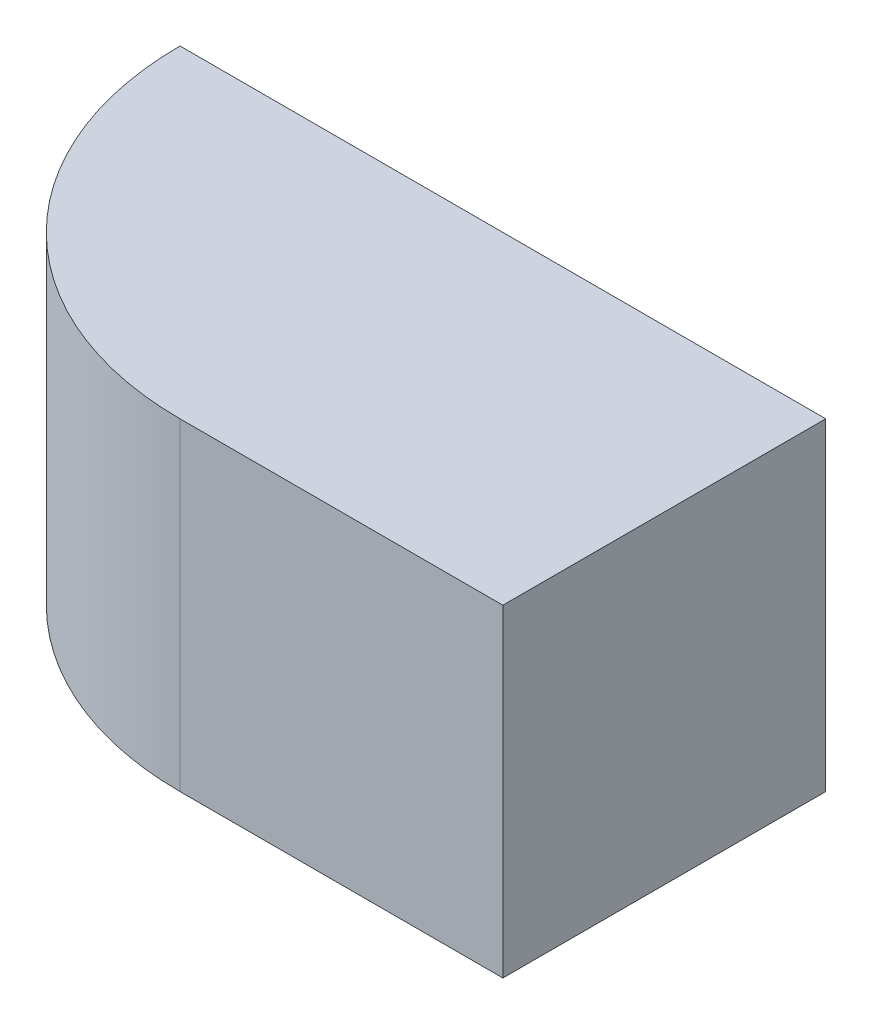
ISO-10303-21;
HEADER;
FILE_DESCRIPTION(('STEP AP214'),'2;1');
FILE_NAME('part.step','',(''),(''),'','','');
FILE_SCHEMA(('AUTOMOTIVE_DESIGN { 1 0 10303 214 1 1 1 1 }'));
ENDSEC;
DATA;
#1=APPLICATION_CONTEXT('core data for automotive mechanical design processes');
#2=APPLICATION_PROTOCOL_DEFINITION('international standard','automotive_design',2000,#1);
#3=PRODUCT_CONTEXT('',#1,'mechanical');
#4=PRODUCT('Part','Part','',(#3));
#5=PRODUCT_RELATED_PRODUCT_CATEGORY('part','',(#4));
#6=PRODUCT_DEFINITION_FORMATION('','',#4);
#7=PRODUCT_DEFINITION_CONTEXT('part definition',#1,'design');
#8=PRODUCT_DEFINITION('design','',#6,#7);
#9=PRODUCT_DEFINITION_SHAPE('','',#8);
#10=(LENGTH_UNIT() NAMED_UNIT(*) SI_UNIT(.MILLI.,.METRE.));
#11=(NAMED_UNIT(*) PLANE_ANGLE_UNIT() SI_UNIT($,.RADIAN.));
#12=(NAMED_UNIT(*) SI_UNIT($,.STERADIAN.) SOLID_ANGLE_UNIT());
#13=UNCERTAINTY_MEASURE_WITH_UNIT(LENGTH_MEASURE(1.E-05),#10,'distance_accuracy_value','');
#14=(GEOMETRIC_REPRESENTATION_CONTEXT(3) GLOBAL_UNCERTAINTY_ASSIGNED_CONTEXT((#13)) GLOBAL_UNIT_ASSIGNED_CONTEXT((#10,
#11,#12)) REPRESENTATION_CONTEXT('',''));
#15=CARTESIAN_POINT('',(0.,0.,0.));
#16=DIRECTION('',(0.,0.,1.));
#17=DIRECTION('',(1.,0.,0.));
#18=AXIS2_PLACEMENT_3D('',#15,#16,#17);
#19=CARTESIAN_POINT('',(-2.00000002980232,-7.75000013038516,2.));
#20=DIRECTION('',(0.,0.,1.));
#21=DIRECTION('',(1.,0.,0.));
#22=AXIS2_PLACEMENT_3D('',#19,#20,#21);
#23=PLANE('',#22);
#24=DIRECTION('',(-1.,0.,0.));
#25=VECTOR('',#24,1.);
#26=CARTESIAN_POINT('',(-1.50000002235174,-8.00000013411045,2.));
#27=LINE('',#26,#25);
#28=CARTESIAN_POINT('',(-1.50000002235174,-8.00000013411045,2.));
#29=VERTEX_POINT('',#28);
#30=CARTESIAN_POINT('',(-2.5000000372529,-8.00000013411045,2.));
#31=VERTEX_POINT('',#30);
#32=EDGE_CURVE('E84',#29,#31,#27,.T.);
#33=ORIENTED_EDGE('',*,*,#32,.T.);
#34=DIRECTION('',(0.,1.,0.));
#35=VECTOR('',#34,1.);
#36=CARTESIAN_POINT('',(-2.5000000372529,-8.00000013411045,2.));
#37=LINE('',#36,#35);
#38=CARTESIAN_POINT('',(-2.5000000372529,-7.50000012665987,2.));
#39=VERTEX_POINT('',#38);
#40=EDGE_CURVE('E96',#31,#39,#37,.T.);
#41=ORIENTED_EDGE('',*,*,#40,.T.);
#42=DIRECTION('',(1.,0.,0.));
#43=VECTOR('',#42,1.);
#44=CARTESIAN_POINT('',(-2.5000000372529,-7.50000012665987,2.));
#45=LINE('',#44,#43);
#46=CARTESIAN_POINT('',(-1.50000002235174,-7.50000012665987,2.));
#47=VERTEX_POINT('',#46);
#48=EDGE_CURVE('E79',#39,#47,#45,.T.);
#49=ORIENTED_EDGE('',*,*,#48,.T.);
#50=DIRECTION('',(0.,-1.,0.));
#51=VECTOR('',#50,1.);
#52=CARTESIAN_POINT('',(-1.50000002235174,-7.50000012665987,2.));
#53=LINE('',#52,#51);
#54=EDGE_CURVE('E28',#47,#29,#53,.T.);
#55=ORIENTED_EDGE('',*,*,#54,.T.);
#56=EDGE_LOOP('',(#33,#41,#49,#55));
#57=FACE_BOUND('',#56,.T.);
#58=ADVANCED_FACE('F17',(#57),#23,.F.);
#59=CARTESIAN_POINT('',(-2.00000002980232,-7.75000013038516,2.5));
#60=DIRECTION('',(0.,0.,1.));
#61=DIRECTION('',(1.,0.,0.));
#62=AXIS2_PLACEMENT_3D('',#59,#60,#61);
#63=PLANE('',#62);
#64=DIRECTION('',(0.,1.,0.));
#65=VECTOR('',#64,1.);
#66=CARTESIAN_POINT('',(-2.0000000372529,-7.62500012852252,2.5));
#67=LINE('',#66,#65);
#68=CARTESIAN_POINT('',(-2.0000000372529,-8.00000013411045,2.5));
#69=VERTEX_POINT('',#68);
#70=CARTESIAN_POINT('',(-2.0000000372529,-7.50000012665987,2.5));
#71=VERTEX_POINT('',#70);
#72=EDGE_CURVE('E110',#69,#71,#67,.T.);
#73=ORIENTED_EDGE('',*,*,#72,.F.);
#74=DIRECTION('',(1.,0.,0.));
#75=VECTOR('',#74,1.);
#76=CARTESIAN_POINT('',(-1.50000002235174,-8.00000013411045,2.5));
#77=LINE('',#76,#75);
#78=CARTESIAN_POINT('',(-1.50000002235174,-8.00000013411045,2.5));
#79=VERTEX_POINT('',#78);
#80=EDGE_CURVE('E62',#69,#79,#77,.T.);
#81=ORIENTED_EDGE('',*,*,#80,.T.);
#82=DIRECTION('',(0.,1.,0.));
#83=VECTOR('',#82,1.);
#84=CARTESIAN_POINT('',(-1.50000002235174,-7.50000012665987,2.5));
#85=LINE('',#84,#83);
#86=CARTESIAN_POINT('',(-1.50000002235174,-7.50000012665987,2.5));
#87=VERTEX_POINT('',#86);
#88=EDGE_CURVE('E11',#79,#87,#85,.T.);
#89=ORIENTED_EDGE('',*,*,#88,.T.);
#90=DIRECTION('',(-1.,0.,0.));
#91=VECTOR('',#90,1.);
#92=CARTESIAN_POINT('',(-2.5000000372529,-7.50000012665987,2.5));
#93=LINE('',#92,#91);
#94=EDGE_CURVE('E21',#87,#71,#93,.T.);
#95=ORIENTED_EDGE('',*,*,#94,.T.);
#96=EDGE_LOOP('',(#73,#81,#89,#95));
#97=FACE_BOUND('',#96,.T.);
#98=ADVANCED_FACE('F19',(#97),#63,.T.);
#99=CARTESIAN_POINT('',(-1.50000002235174,-8.00000013411045,2.));
#100=DIRECTION('',(1.,0.,0.));
#101=DIRECTION('',(0.,1.,0.));
#102=AXIS2_PLACEMENT_3D('',#99,#100,#101);
#103=PLANE('',#102);
#104=ORIENTED_EDGE('',*,*,#54,.F.);
#105=DIRECTION('',(0.,0.,1.));
#106=VECTOR('',#105,1.);
#107=CARTESIAN_POINT('',(-1.50000002235174,-7.50000012665987,2.));
#108=LINE('',#107,#106);
#109=EDGE_CURVE('E112',#47,#87,#108,.T.);
#110=ORIENTED_EDGE('',*,*,#109,.T.);
#111=ORIENTED_EDGE('',*,*,#88,.F.);
#112=DIRECTION('',(0.,0.,1.));
#113=VECTOR('',#112,1.);
#114=CARTESIAN_POINT('',(-1.50000002235174,-8.00000013411045,2.));
#115=LINE('',#114,#113);
#116=EDGE_CURVE('E88',#29,#79,#115,.T.);
#117=ORIENTED_EDGE('',*,*,#116,.F.);
#118=EDGE_LOOP('',(#104,#110,#111,#117));
#119=FACE_BOUND('',#118,.T.);
#120=ADVANCED_FACE('F89',(#119),#103,.T.);
#121=CARTESIAN_POINT('',(-1.50000002235174,-7.50000012665987,2.));
#122=DIRECTION('',(0.,1.,0.));
#123=DIRECTION('',(1.,0.,0.));
#124=AXIS2_PLACEMENT_3D('',#121,#122,#123);
#125=PLANE('',#124);
#126=CARTESIAN_POINT('',(-2.0000000372529,-7.50000012665987,2.));
#127=DIRECTION('',(0.,-1.,0.));
#128=DIRECTION('',(-0.707106781186548,0.,0.707106781186548));
#129=AXIS2_PLACEMENT_3D('',#126,#127,#128);
#130=CIRCLE('',#129,0.5);
#131=EDGE_CURVE('E102',#71,#39,#130,.T.);
#132=ORIENTED_EDGE('',*,*,#131,.F.);
#133=ORIENTED_EDGE('',*,*,#94,.F.);
#134=ORIENTED_EDGE('',*,*,#109,.F.);
#135=ORIENTED_EDGE('',*,*,#48,.F.);
#136=EDGE_LOOP('',(#132,#133,#134,#135));
#137=FACE_BOUND('',#136,.T.);
#138=ADVANCED_FACE('F122',(#137),#125,.T.);
#139=CARTESIAN_POINT('',(-2.5000000372529,-8.00000013411045,2.));
#140=DIRECTION('',(0.,-1.,0.));
#141=DIRECTION('',(0.,0.,-1.));
#142=AXIS2_PLACEMENT_3D('',#139,#140,#141);
#143=PLANE('',#142);
#144=CARTESIAN_POINT('',(-2.0000000372529,-8.00000013411045,2.));
#145=DIRECTION('',(0.,1.,0.));
#146=DIRECTION('',(-0.707106781186548,0.,0.707106781186548));
#147=AXIS2_PLACEMENT_3D('',#144,#145,#146);
#148=CIRCLE('',#147,0.5);
#149=EDGE_CURVE('E94',#31,#69,#148,.T.);
#150=ORIENTED_EDGE('',*,*,#149,.F.);
#151=ORIENTED_EDGE('',*,*,#32,.F.);
#152=ORIENTED_EDGE('',*,*,#116,.T.);
#153=ORIENTED_EDGE('',*,*,#80,.F.);
#154=EDGE_LOOP('',(#150,#151,#152,#153));
#155=FACE_BOUND('',#154,.T.);
#156=ADVANCED_FACE('F92',(#155),#143,.T.);
#157=CARTESIAN_POINT('',(-2.0000000372529,-7.62500012852252,2.));
#158=DIRECTION('',(0.,-1.,0.));
#159=DIRECTION('',(-0.707106781186548,0.,0.707106781186548));
#160=AXIS2_PLACEMENT_3D('',#157,#158,#159);
#161=CYLINDRICAL_SURFACE('',#160,0.5);
#162=ORIENTED_EDGE('',*,*,#149,.T.);
#163=ORIENTED_EDGE('',*,*,#72,.T.);
#164=ORIENTED_EDGE('',*,*,#131,.T.);
#165=ORIENTED_EDGE('',*,*,#40,.F.);
#166=EDGE_LOOP('',(#162,#163,#164,#165));
#167=FACE_BOUND('',#166,.T.);
#168=ADVANCED_FACE('F121',(#167),#161,.T.);
#169=CLOSED_SHELL('',(#58,#98,#120,#138,#156,#168));
#170=MANIFOLD_SOLID_BREP('B1',#169);
#171=ADVANCED_BREP_SHAPE_REPRESENTATION('',(#18,#170),#14);
#172=SHAPE_DEFINITION_REPRESENTATION(#9,#171);
ENDSEC;
END-ISO-10303-21;
